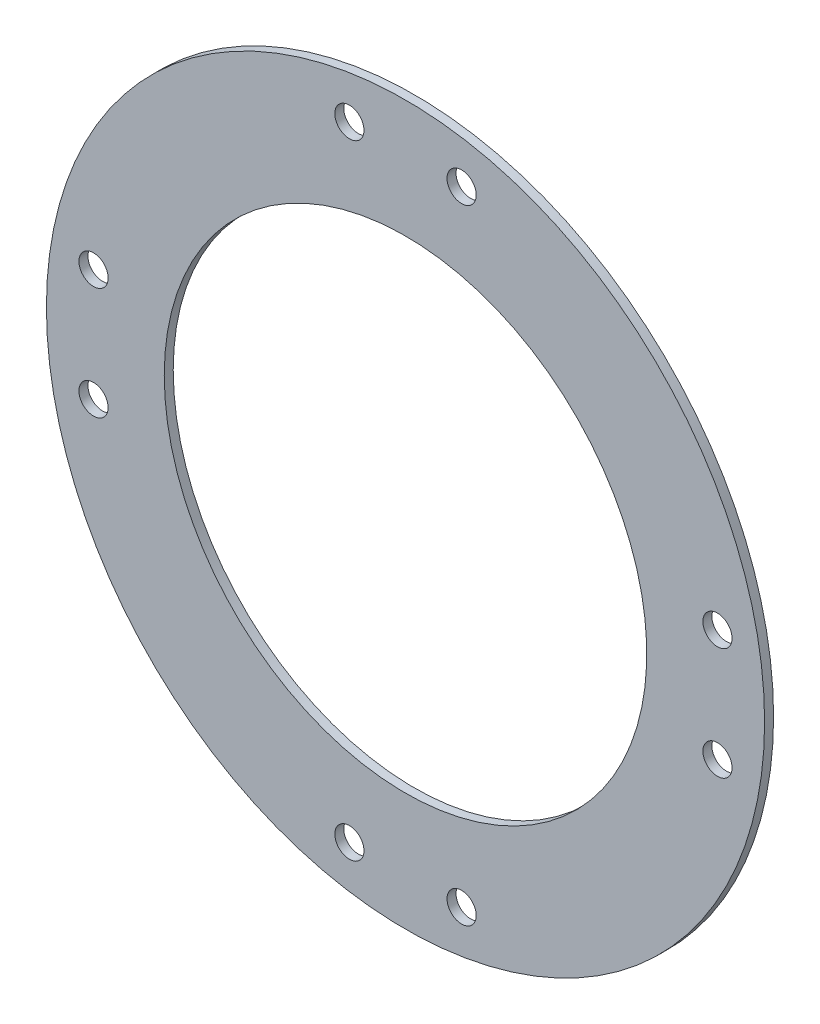
ISO-10303-21;
HEADER;
FILE_DESCRIPTION(('STEP AP214'),'2;1');
FILE_NAME('part.step','',(''),(''),'','','');
FILE_SCHEMA(('AUTOMOTIVE_DESIGN { 1 0 10303 214 1 1 1 1 }'));
ENDSEC;
DATA;
#1=APPLICATION_CONTEXT('core data for automotive mechanical design processes');
#2=APPLICATION_PROTOCOL_DEFINITION('international standard','automotive_design',2000,#1);
#3=PRODUCT_CONTEXT('',#1,'mechanical');
#4=PRODUCT('Part','Part','',(#3));
#5=PRODUCT_RELATED_PRODUCT_CATEGORY('part','',(#4));
#6=PRODUCT_DEFINITION_FORMATION('','',#4);
#7=PRODUCT_DEFINITION_CONTEXT('part definition',#1,'design');
#8=PRODUCT_DEFINITION('design','',#6,#7);
#9=PRODUCT_DEFINITION_SHAPE('','',#8);
#10=(LENGTH_UNIT() NAMED_UNIT(*) SI_UNIT(.MILLI.,.METRE.));
#11=(NAMED_UNIT(*) PLANE_ANGLE_UNIT() SI_UNIT($,.RADIAN.));
#12=(NAMED_UNIT(*) SI_UNIT($,.STERADIAN.) SOLID_ANGLE_UNIT());
#13=UNCERTAINTY_MEASURE_WITH_UNIT(LENGTH_MEASURE(1.E-05),#10,'distance_accuracy_value','');
#14=(GEOMETRIC_REPRESENTATION_CONTEXT(3) GLOBAL_UNCERTAINTY_ASSIGNED_CONTEXT((#13)) GLOBAL_UNIT_ASSIGNED_CONTEXT((#10,
#11,#12)) REPRESENTATION_CONTEXT('',''));
#15=CARTESIAN_POINT('',(0.,0.,0.));
#16=DIRECTION('',(0.,0.,1.));
#17=DIRECTION('',(1.,0.,0.));
#18=AXIS2_PLACEMENT_3D('',#15,#16,#17);
#19=CARTESIAN_POINT('',(0.,0.,-1246.));
#20=DIRECTION('',(0.,0.,-1.));
#21=DIRECTION('',(-1.,0.,0.));
#22=AXIS2_PLACEMENT_3D('',#19,#20,#21);
#23=PLANE('',#22);
#24=CARTESIAN_POINT('',(-139.,-24.9999999999995,-1246.));
#25=DIRECTION('',(0.,0.,1.));
#26=DIRECTION('',(1.,0.,0.));
#27=AXIS2_PLACEMENT_3D('',#24,#25,#26);
#28=CIRCLE('',#27,6.50000000000001);
#29=CARTESIAN_POINT('',(-132.5,-24.9999999999995,-1246.));
#30=VERTEX_POINT('',#29);
#31=EDGE_CURVE('E70',#30,#30,#28,.T.);
#32=ORIENTED_EDGE('',*,*,#31,.F.);
#33=EDGE_LOOP('',(#32));
#34=FACE_BOUND('',#33,.T.);
#35=CARTESIAN_POINT('',(-25.,-139.,-1246.));
#36=DIRECTION('',(0.,0.,1.));
#37=DIRECTION('',(1.,0.,0.));
#38=AXIS2_PLACEMENT_3D('',#35,#36,#37);
#39=CIRCLE('',#38,6.5);
#40=CARTESIAN_POINT('',(-18.5,-139.,-1246.));
#41=VERTEX_POINT('',#40);
#42=EDGE_CURVE('E64',#41,#41,#39,.T.);
#43=ORIENTED_EDGE('',*,*,#42,.F.);
#44=EDGE_LOOP('',(#43));
#45=FACE_BOUND('',#44,.T.);
#46=CARTESIAN_POINT('',(25.,-139.,-1246.));
#47=DIRECTION('',(0.,0.,1.));
#48=DIRECTION('',(1.,0.,0.));
#49=AXIS2_PLACEMENT_3D('',#46,#47,#48);
#50=CIRCLE('',#49,6.5);
#51=CARTESIAN_POINT('',(31.5,-139.,-1246.));
#52=VERTEX_POINT('',#51);
#53=EDGE_CURVE('E58',#52,#52,#50,.T.);
#54=ORIENTED_EDGE('',*,*,#53,.F.);
#55=EDGE_LOOP('',(#54));
#56=FACE_BOUND('',#55,.T.);
#57=CARTESIAN_POINT('',(0.,0.,-1246.));
#58=DIRECTION('',(0.,0.,-1.));
#59=DIRECTION('',(-1.,0.,0.));
#60=AXIS2_PLACEMENT_3D('',#57,#58,#59);
#61=CIRCLE('',#60,160.);
#62=CARTESIAN_POINT('',(-160.,0.,-1246.));
#63=VERTEX_POINT('',#62);
#64=EDGE_CURVE('E41',#63,#63,#61,.T.);
#65=ORIENTED_EDGE('',*,*,#64,.F.);
#66=EDGE_LOOP('',(#65));
#67=FACE_BOUND('',#66,.T.);
#68=CARTESIAN_POINT('',(0.,0.,-1246.));
#69=DIRECTION('',(0.,0.,-1.));
#70=DIRECTION('',(-1.,0.,0.));
#71=AXIS2_PLACEMENT_3D('',#68,#69,#70);
#72=CIRCLE('',#71,107.5);
#73=CARTESIAN_POINT('',(-107.5,0.,-1246.));
#74=VERTEX_POINT('',#73);
#75=EDGE_CURVE('E50',#74,#74,#72,.T.);
#76=ORIENTED_EDGE('',*,*,#75,.T.);
#77=EDGE_LOOP('',(#76));
#78=FACE_BOUND('',#77,.T.);
#79=CARTESIAN_POINT('',(-139.,25.0000000000005,-1246.));
#80=DIRECTION('',(0.,0.,1.));
#81=DIRECTION('',(1.,0.,0.));
#82=AXIS2_PLACEMENT_3D('',#79,#80,#81);
#83=CIRCLE('',#82,6.50000000000001);
#84=CARTESIAN_POINT('',(-132.5,25.0000000000005,-1246.));
#85=VERTEX_POINT('',#84);
#86=EDGE_CURVE('E76',#85,#85,#83,.T.);
#87=ORIENTED_EDGE('',*,*,#86,.F.);
#88=EDGE_LOOP('',(#87));
#89=FACE_BOUND('',#88,.T.);
#90=CARTESIAN_POINT('',(-25.,139.,-1246.));
#91=DIRECTION('',(0.,0.,1.));
#92=DIRECTION('',(1.,0.,0.));
#93=AXIS2_PLACEMENT_3D('',#90,#91,#92);
#94=CIRCLE('',#93,6.5);
#95=CARTESIAN_POINT('',(-18.5,139.,-1246.));
#96=VERTEX_POINT('',#95);
#97=EDGE_CURVE('E82',#96,#96,#94,.T.);
#98=ORIENTED_EDGE('',*,*,#97,.F.);
#99=EDGE_LOOP('',(#98));
#100=FACE_BOUND('',#99,.T.);
#101=CARTESIAN_POINT('',(25.,139.,-1246.));
#102=DIRECTION('',(0.,0.,1.));
#103=DIRECTION('',(1.,0.,0.));
#104=AXIS2_PLACEMENT_3D('',#101,#102,#103);
#105=CIRCLE('',#104,6.5);
#106=CARTESIAN_POINT('',(31.5,139.,-1246.));
#107=VERTEX_POINT('',#106);
#108=EDGE_CURVE('E88',#107,#107,#105,.T.);
#109=ORIENTED_EDGE('',*,*,#108,.F.);
#110=EDGE_LOOP('',(#109));
#111=FACE_BOUND('',#110,.T.);
#112=CARTESIAN_POINT('',(139.,24.9999999999986,-1246.));
#113=DIRECTION('',(0.,0.,1.));
#114=DIRECTION('',(1.,0.,0.));
#115=AXIS2_PLACEMENT_3D('',#112,#113,#114);
#116=CIRCLE('',#115,6.50000000000001);
#117=CARTESIAN_POINT('',(145.5,24.9999999999986,-1246.));
#118=VERTEX_POINT('',#117);
#119=EDGE_CURVE('E94',#118,#118,#116,.T.);
#120=ORIENTED_EDGE('',*,*,#119,.F.);
#121=EDGE_LOOP('',(#120));
#122=FACE_BOUND('',#121,.T.);
#123=CARTESIAN_POINT('',(139.,-25.0000000000014,-1246.));
#124=DIRECTION('',(0.,0.,1.));
#125=DIRECTION('',(1.,0.,0.));
#126=AXIS2_PLACEMENT_3D('',#123,#124,#125);
#127=CIRCLE('',#126,6.50000000000001);
#128=CARTESIAN_POINT('',(145.5,-25.0000000000014,-1246.));
#129=VERTEX_POINT('',#128);
#130=EDGE_CURVE('E100',#129,#129,#127,.T.);
#131=ORIENTED_EDGE('',*,*,#130,.F.);
#132=EDGE_LOOP('',(#131));
#133=FACE_BOUND('',#132,.T.);
#134=ADVANCED_FACE('F37',(#34,#45,#56,#67,#78,#89,#100,#111,#122,#133),#23,.F.);
#135=CARTESIAN_POINT('',(0.,0.,-1250.));
#136=DIRECTION('',(0.,0.,-1.));
#137=DIRECTION('',(-1.,0.,0.));
#138=AXIS2_PLACEMENT_3D('',#135,#136,#137);
#139=PLANE('',#138);
#140=CARTESIAN_POINT('',(139.,-25.0000000000014,-1250.));
#141=DIRECTION('',(0.,0.,-1.));
#142=DIRECTION('',(-1.,0.,0.));
#143=AXIS2_PLACEMENT_3D('',#140,#141,#142);
#144=CIRCLE('',#143,6.50000000000001);
#145=CARTESIAN_POINT('',(132.5,-25.0000000000014,-1250.));
#146=VERTEX_POINT('',#145);
#147=EDGE_CURVE('E97',#146,#146,#144,.T.);
#148=ORIENTED_EDGE('',*,*,#147,.F.);
#149=EDGE_LOOP('',(#148));
#150=FACE_BOUND('',#149,.T.);
#151=CARTESIAN_POINT('',(139.,24.9999999999986,-1250.));
#152=DIRECTION('',(0.,0.,-1.));
#153=DIRECTION('',(-1.,0.,0.));
#154=AXIS2_PLACEMENT_3D('',#151,#152,#153);
#155=CIRCLE('',#154,6.50000000000001);
#156=CARTESIAN_POINT('',(132.5,24.9999999999986,-1250.));
#157=VERTEX_POINT('',#156);
#158=EDGE_CURVE('E91',#157,#157,#155,.T.);
#159=ORIENTED_EDGE('',*,*,#158,.F.);
#160=EDGE_LOOP('',(#159));
#161=FACE_BOUND('',#160,.T.);
#162=CARTESIAN_POINT('',(25.,139.,-1250.));
#163=DIRECTION('',(0.,0.,-1.));
#164=DIRECTION('',(-1.,0.,0.));
#165=AXIS2_PLACEMENT_3D('',#162,#163,#164);
#166=CIRCLE('',#165,6.5);
#167=CARTESIAN_POINT('',(18.5,139.,-1250.));
#168=VERTEX_POINT('',#167);
#169=EDGE_CURVE('E85',#168,#168,#166,.T.);
#170=ORIENTED_EDGE('',*,*,#169,.F.);
#171=EDGE_LOOP('',(#170));
#172=FACE_BOUND('',#171,.T.);
#173=CARTESIAN_POINT('',(-25.,139.,-1250.));
#174=DIRECTION('',(0.,0.,-1.));
#175=DIRECTION('',(-1.,0.,0.));
#176=AXIS2_PLACEMENT_3D('',#173,#174,#175);
#177=CIRCLE('',#176,6.5);
#178=CARTESIAN_POINT('',(-31.5,139.,-1250.));
#179=VERTEX_POINT('',#178);
#180=EDGE_CURVE('E79',#179,#179,#177,.T.);
#181=ORIENTED_EDGE('',*,*,#180,.F.);
#182=EDGE_LOOP('',(#181));
#183=FACE_BOUND('',#182,.T.);
#184=CARTESIAN_POINT('',(-139.,25.0000000000005,-1250.));
#185=DIRECTION('',(0.,0.,-1.));
#186=DIRECTION('',(-1.,0.,0.));
#187=AXIS2_PLACEMENT_3D('',#184,#185,#186);
#188=CIRCLE('',#187,6.50000000000001);
#189=CARTESIAN_POINT('',(-145.5,25.0000000000005,-1250.));
#190=VERTEX_POINT('',#189);
#191=EDGE_CURVE('E73',#190,#190,#188,.T.);
#192=ORIENTED_EDGE('',*,*,#191,.F.);
#193=EDGE_LOOP('',(#192));
#194=FACE_BOUND('',#193,.T.);
#195=CARTESIAN_POINT('',(-139.,-24.9999999999995,-1250.));
#196=DIRECTION('',(0.,0.,-1.));
#197=DIRECTION('',(-1.,0.,0.));
#198=AXIS2_PLACEMENT_3D('',#195,#196,#197);
#199=CIRCLE('',#198,6.50000000000001);
#200=CARTESIAN_POINT('',(-145.5,-24.9999999999995,-1250.));
#201=VERTEX_POINT('',#200);
#202=EDGE_CURVE('E67',#201,#201,#199,.T.);
#203=ORIENTED_EDGE('',*,*,#202,.F.);
#204=EDGE_LOOP('',(#203));
#205=FACE_BOUND('',#204,.T.);
#206=CARTESIAN_POINT('',(-25.,-139.,-1250.));
#207=DIRECTION('',(0.,0.,-1.));
#208=DIRECTION('',(-1.,0.,0.));
#209=AXIS2_PLACEMENT_3D('',#206,#207,#208);
#210=CIRCLE('',#209,6.5);
#211=CARTESIAN_POINT('',(-31.5,-139.,-1250.));
#212=VERTEX_POINT('',#211);
#213=EDGE_CURVE('E61',#212,#212,#210,.T.);
#214=ORIENTED_EDGE('',*,*,#213,.F.);
#215=EDGE_LOOP('',(#214));
#216=FACE_BOUND('',#215,.T.);
#217=CARTESIAN_POINT('',(25.,-139.,-1250.));
#218=DIRECTION('',(0.,0.,-1.));
#219=DIRECTION('',(-1.,0.,0.));
#220=AXIS2_PLACEMENT_3D('',#217,#218,#219);
#221=CIRCLE('',#220,6.5);
#222=CARTESIAN_POINT('',(18.5,-139.,-1250.));
#223=VERTEX_POINT('',#222);
#224=EDGE_CURVE('E53',#223,#223,#221,.T.);
#225=ORIENTED_EDGE('',*,*,#224,.F.);
#226=EDGE_LOOP('',(#225));
#227=FACE_BOUND('',#226,.T.);
#228=CARTESIAN_POINT('',(0.,0.,-1250.));
#229=DIRECTION('',(0.,0.,-1.));
#230=DIRECTION('',(-1.,0.,0.));
#231=AXIS2_PLACEMENT_3D('',#228,#229,#230);
#232=CIRCLE('',#231,160.);
#233=CARTESIAN_POINT('',(-160.,0.,-1250.));
#234=VERTEX_POINT('',#233);
#235=EDGE_CURVE('E10',#234,#234,#232,.T.);
#236=ORIENTED_EDGE('',*,*,#235,.T.);
#237=EDGE_LOOP('',(#236));
#238=FACE_BOUND('',#237,.T.);
#239=CARTESIAN_POINT('',(0.,0.,-1250.));
#240=DIRECTION('',(0.,0.,-1.));
#241=DIRECTION('',(-1.,0.,0.));
#242=AXIS2_PLACEMENT_3D('',#239,#240,#241);
#243=CIRCLE('',#242,107.5);
#244=CARTESIAN_POINT('',(-107.5,0.,-1250.));
#245=VERTEX_POINT('',#244);
#246=EDGE_CURVE('E48',#245,#245,#243,.T.);
#247=ORIENTED_EDGE('',*,*,#246,.F.);
#248=EDGE_LOOP('',(#247));
#249=FACE_BOUND('',#248,.T.);
#250=ADVANCED_FACE('F108',(#150,#161,#172,#183,#194,#205,#216,#227,#238,#249),#139,.T.);
#251=CARTESIAN_POINT('',(0.,0.,-1250.));
#252=DIRECTION('',(0.,0.,1.));
#253=DIRECTION('',(1.,0.,0.));
#254=AXIS2_PLACEMENT_3D('',#251,#252,#253);
#255=CYLINDRICAL_SURFACE('',#254,160.);
#256=ORIENTED_EDGE('',*,*,#235,.F.);
#257=EDGE_LOOP('',(#256));
#258=FACE_BOUND('',#257,.T.);
#259=ORIENTED_EDGE('',*,*,#64,.T.);
#260=EDGE_LOOP('',(#259));
#261=FACE_BOUND('',#260,.T.);
#262=ADVANCED_FACE('F39',(#258,#261),#255,.T.);
#263=CARTESIAN_POINT('',(0.,0.,-1250.));
#264=DIRECTION('',(0.,0.,1.));
#265=DIRECTION('',(1.,0.,0.));
#266=AXIS2_PLACEMENT_3D('',#263,#264,#265);
#267=CYLINDRICAL_SURFACE('',#266,107.5);
#268=ORIENTED_EDGE('',*,*,#246,.T.);
#269=EDGE_LOOP('',(#268));
#270=FACE_BOUND('',#269,.T.);
#271=ORIENTED_EDGE('',*,*,#75,.F.);
#272=EDGE_LOOP('',(#271));
#273=FACE_BOUND('',#272,.T.);
#274=ADVANCED_FACE('F118',(#270,#273),#267,.F.);
#275=CARTESIAN_POINT('',(25.,-139.,-1246.));
#276=DIRECTION('',(0.,0.,1.));
#277=DIRECTION('',(1.,0.,0.));
#278=AXIS2_PLACEMENT_3D('',#275,#276,#277);
#279=CYLINDRICAL_SURFACE('',#278,6.5);
#280=ORIENTED_EDGE('',*,*,#53,.T.);
#281=EDGE_LOOP('',(#280));
#282=FACE_BOUND('',#281,.T.);
#283=ORIENTED_EDGE('',*,*,#224,.T.);
#284=EDGE_LOOP('',(#283));
#285=FACE_BOUND('',#284,.T.);
#286=ADVANCED_FACE('F121',(#282,#285),#279,.F.);
#287=CARTESIAN_POINT('',(-25.,-139.,-1246.));
#288=DIRECTION('',(0.,0.,1.));
#289=DIRECTION('',(1.,0.,0.));
#290=AXIS2_PLACEMENT_3D('',#287,#288,#289);
#291=CYLINDRICAL_SURFACE('',#290,6.5);
#292=ORIENTED_EDGE('',*,*,#42,.T.);
#293=EDGE_LOOP('',(#292));
#294=FACE_BOUND('',#293,.T.);
#295=ORIENTED_EDGE('',*,*,#213,.T.);
#296=EDGE_LOOP('',(#295));
#297=FACE_BOUND('',#296,.T.);
#298=ADVANCED_FACE('F125',(#294,#297),#291,.F.);
#299=CARTESIAN_POINT('',(-139.,-24.9999999999995,-1246.));
#300=DIRECTION('',(0.,0.,1.));
#301=DIRECTION('',(1.,0.,0.));
#302=AXIS2_PLACEMENT_3D('',#299,#300,#301);
#303=CYLINDRICAL_SURFACE('',#302,6.50000000000001);
#304=ORIENTED_EDGE('',*,*,#31,.T.);
#305=EDGE_LOOP('',(#304));
#306=FACE_BOUND('',#305,.T.);
#307=ORIENTED_EDGE('',*,*,#202,.T.);
#308=EDGE_LOOP('',(#307));
#309=FACE_BOUND('',#308,.T.);
#310=ADVANCED_FACE('F129',(#306,#309),#303,.F.);
#311=CARTESIAN_POINT('',(-139.,25.0000000000005,-1246.));
#312=DIRECTION('',(0.,0.,1.));
#313=DIRECTION('',(1.,0.,0.));
#314=AXIS2_PLACEMENT_3D('',#311,#312,#313);
#315=CYLINDRICAL_SURFACE('',#314,6.50000000000001);
#316=ORIENTED_EDGE('',*,*,#86,.T.);
#317=EDGE_LOOP('',(#316));
#318=FACE_BOUND('',#317,.T.);
#319=ORIENTED_EDGE('',*,*,#191,.T.);
#320=EDGE_LOOP('',(#319));
#321=FACE_BOUND('',#320,.T.);
#322=ADVANCED_FACE('F133',(#318,#321),#315,.F.);
#323=CARTESIAN_POINT('',(-25.,139.,-1246.));
#324=DIRECTION('',(0.,0.,1.));
#325=DIRECTION('',(1.,0.,0.));
#326=AXIS2_PLACEMENT_3D('',#323,#324,#325);
#327=CYLINDRICAL_SURFACE('',#326,6.5);
#328=ORIENTED_EDGE('',*,*,#97,.T.);
#329=EDGE_LOOP('',(#328));
#330=FACE_BOUND('',#329,.T.);
#331=ORIENTED_EDGE('',*,*,#180,.T.);
#332=EDGE_LOOP('',(#331));
#333=FACE_BOUND('',#332,.T.);
#334=ADVANCED_FACE('F137',(#330,#333),#327,.F.);
#335=CARTESIAN_POINT('',(25.,139.,-1246.));
#336=DIRECTION('',(0.,0.,1.));
#337=DIRECTION('',(1.,0.,0.));
#338=AXIS2_PLACEMENT_3D('',#335,#336,#337);
#339=CYLINDRICAL_SURFACE('',#338,6.5);
#340=ORIENTED_EDGE('',*,*,#108,.T.);
#341=EDGE_LOOP('',(#340));
#342=FACE_BOUND('',#341,.T.);
#343=ORIENTED_EDGE('',*,*,#169,.T.);
#344=EDGE_LOOP('',(#343));
#345=FACE_BOUND('',#344,.T.);
#346=ADVANCED_FACE('F141',(#342,#345),#339,.F.);
#347=CARTESIAN_POINT('',(139.,24.9999999999986,-1246.));
#348=DIRECTION('',(0.,0.,1.));
#349=DIRECTION('',(1.,0.,0.));
#350=AXIS2_PLACEMENT_3D('',#347,#348,#349);
#351=CYLINDRICAL_SURFACE('',#350,6.50000000000001);
#352=ORIENTED_EDGE('',*,*,#119,.T.);
#353=EDGE_LOOP('',(#352));
#354=FACE_BOUND('',#353,.T.);
#355=ORIENTED_EDGE('',*,*,#158,.T.);
#356=EDGE_LOOP('',(#355));
#357=FACE_BOUND('',#356,.T.);
#358=ADVANCED_FACE('F145',(#354,#357),#351,.F.);
#359=CARTESIAN_POINT('',(139.,-25.0000000000014,-1246.));
#360=DIRECTION('',(0.,0.,1.));
#361=DIRECTION('',(1.,0.,0.));
#362=AXIS2_PLACEMENT_3D('',#359,#360,#361);
#363=CYLINDRICAL_SURFACE('',#362,6.50000000000001);
#364=ORIENTED_EDGE('',*,*,#130,.T.);
#365=EDGE_LOOP('',(#364));
#366=FACE_BOUND('',#365,.T.);
#367=ORIENTED_EDGE('',*,*,#147,.T.);
#368=EDGE_LOOP('',(#367));
#369=FACE_BOUND('',#368,.T.);
#370=ADVANCED_FACE('F104',(#366,#369),#363,.F.);
#371=CLOSED_SHELL('',(#134,#250,#262,#274,#286,#298,#310,#322,#334,#346,#358,#370));
#372=MANIFOLD_SOLID_BREP('B2',#371);
#373=ADVANCED_BREP_SHAPE_REPRESENTATION('',(#18,#372),#14);
#374=SHAPE_DEFINITION_REPRESENTATION(#9,#373);
ENDSEC;
END-ISO-10303-21;
